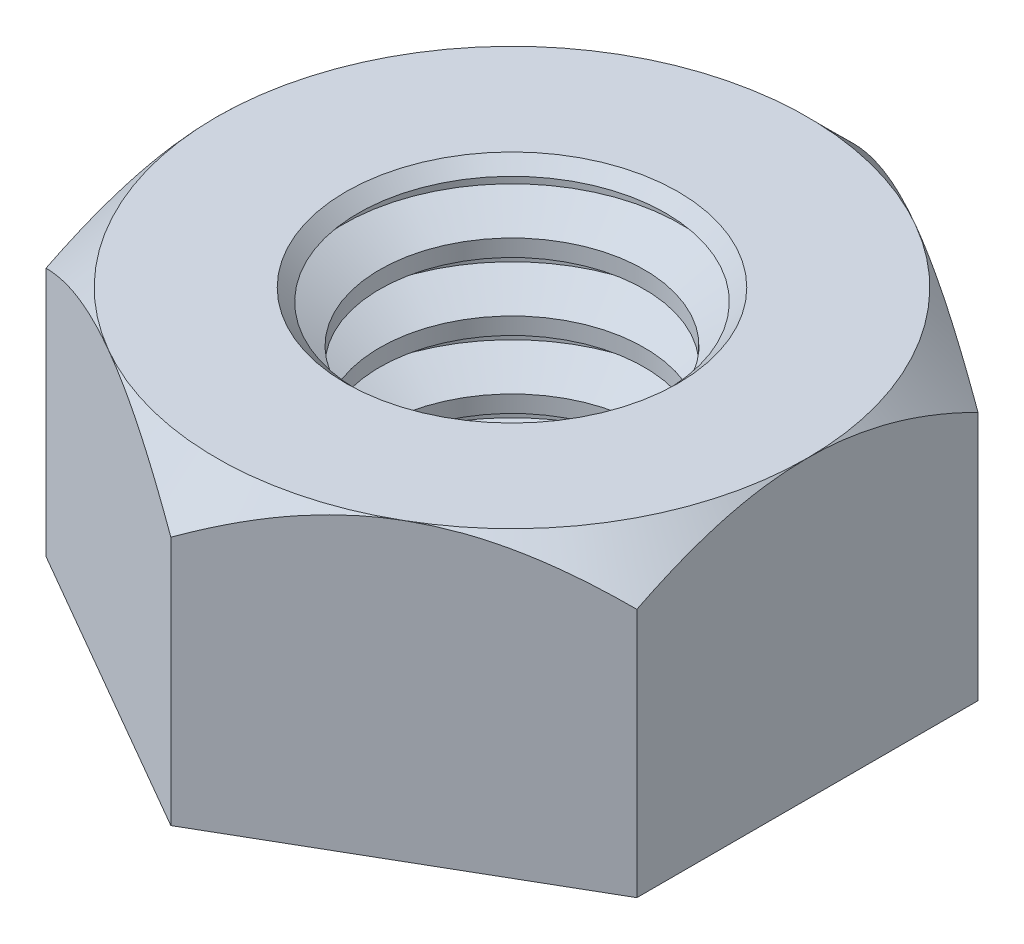
ISO-10303-21;
HEADER;
FILE_DESCRIPTION(('STEP AP214'),'2;1');
FILE_NAME('part.step','',(''),(''),'','','');
FILE_SCHEMA(('AUTOMOTIVE_DESIGN { 1 0 10303 214 1 1 1 1 }'));
ENDSEC;
DATA;
#1=APPLICATION_CONTEXT('core data for automotive mechanical design processes');
#2=APPLICATION_PROTOCOL_DEFINITION('international standard','automotive_design',2000,#1);
#3=PRODUCT_CONTEXT('',#1,'mechanical');
#4=PRODUCT('Part','Part','',(#3));
#5=PRODUCT_RELATED_PRODUCT_CATEGORY('part','',(#4));
#6=PRODUCT_DEFINITION_FORMATION('','',#4);
#7=PRODUCT_DEFINITION_CONTEXT('part definition',#1,'design');
#8=PRODUCT_DEFINITION('design','',#6,#7);
#9=PRODUCT_DEFINITION_SHAPE('','',#8);
#10=(LENGTH_UNIT() NAMED_UNIT(*) SI_UNIT(.MILLI.,.METRE.));
#11=(NAMED_UNIT(*) PLANE_ANGLE_UNIT() SI_UNIT($,.RADIAN.));
#12=(NAMED_UNIT(*) SI_UNIT($,.STERADIAN.) SOLID_ANGLE_UNIT());
#13=UNCERTAINTY_MEASURE_WITH_UNIT(LENGTH_MEASURE(1.E-05),#10,'distance_accuracy_value','');
#14=(GEOMETRIC_REPRESENTATION_CONTEXT(3) GLOBAL_UNCERTAINTY_ASSIGNED_CONTEXT((#13)) GLOBAL_UNIT_ASSIGNED_CONTEXT((#10,
#11,#12)) REPRESENTATION_CONTEXT('',''));
#15=CARTESIAN_POINT('',(0.,0.,0.));
#16=DIRECTION('',(0.,0.,1.));
#17=DIRECTION('',(1.,0.,0.));
#18=AXIS2_PLACEMENT_3D('',#15,#16,#17);
#19=CARTESIAN_POINT('',(-5.55625,0.,-9.62370729955457));
#20=DIRECTION('',(0.,1.,0.));
#21=DIRECTION('',(0.,0.,1.));
#22=AXIS2_PLACEMENT_3D('',#19,#20,#21);
#23=PLANE('',#22);
#24=DIRECTION('',(-0.866025403784439,0.,-0.5));
#25=VECTOR('',#24,1.);
#26=CARTESIAN_POINT('',(5.55625,0.,-3.20790243318486));
#27=LINE('',#26,#25);
#28=CARTESIAN_POINT('',(5.55625,0.,-3.20790243318486));
#29=VERTEX_POINT('',#28);
#30=CARTESIAN_POINT('',(0.,0.,-6.41580486636972));
#31=VERTEX_POINT('',#30);
#32=EDGE_CURVE('E263',#29,#31,#27,.T.);
#33=ORIENTED_EDGE('',*,*,#32,.F.);
#34=DIRECTION('',(0.,0.,-1.));
#35=VECTOR('',#34,1.);
#36=CARTESIAN_POINT('',(5.55625,0.,3.20790243318485));
#37=LINE('',#36,#35);
#38=CARTESIAN_POINT('',(5.55625,0.,3.20790243318485));
#39=VERTEX_POINT('',#38);
#40=EDGE_CURVE('E270',#39,#29,#37,.T.);
#41=ORIENTED_EDGE('',*,*,#40,.F.);
#42=DIRECTION('',(0.866025403784439,0.,-0.5));
#43=VECTOR('',#42,1.);
#44=CARTESIAN_POINT('',(0.,0.,6.41580486636971));
#45=LINE('',#44,#43);
#46=CARTESIAN_POINT('',(0.,0.,6.41580486636971));
#47=VERTEX_POINT('',#46);
#48=EDGE_CURVE('E266',#47,#39,#45,.T.);
#49=ORIENTED_EDGE('',*,*,#48,.F.);
#50=DIRECTION('',(0.866025403784439,0.,0.5));
#51=VECTOR('',#50,1.);
#52=CARTESIAN_POINT('',(-5.55625,0.,3.20790243318486));
#53=LINE('',#52,#51);
#54=CARTESIAN_POINT('',(-5.55625,0.,3.20790243318486));
#55=VERTEX_POINT('',#54);
#56=EDGE_CURVE('E124',#55,#47,#53,.T.);
#57=ORIENTED_EDGE('',*,*,#56,.F.);
#58=DIRECTION('',(0.,0.,1.));
#59=VECTOR('',#58,1.);
#60=CARTESIAN_POINT('',(-5.55625,0.,-3.20790243318486));
#61=LINE('',#60,#59);
#62=CARTESIAN_POINT('',(-5.55625,0.,-3.20790243318486));
#63=VERTEX_POINT('',#62);
#64=EDGE_CURVE('E262',#63,#55,#61,.T.);
#65=ORIENTED_EDGE('',*,*,#64,.F.);
#66=DIRECTION('',(-0.866025403784438,0.,0.5));
#67=VECTOR('',#66,1.);
#68=CARTESIAN_POINT('',(0.,0.,-6.41580486636972));
#69=LINE('',#68,#67);
#70=EDGE_CURVE('E258',#31,#63,#69,.T.);
#71=ORIENTED_EDGE('',*,*,#70,.F.);
#72=EDGE_LOOP('',(#33,#41,#49,#57,#65,#71));
#73=FACE_BOUND('',#72,.T.);
#74=CARTESIAN_POINT('',(0.,0.,0.));
#75=DIRECTION('',(0.,1.,0.));
#76=DIRECTION('',(0.,0.,1.));
#77=AXIS2_PLACEMENT_3D('',#74,#75,#76);
#78=CIRCLE('',#77,3.175);
#79=CARTESIAN_POINT('',(0.,0.,3.175));
#80=VERTEX_POINT('',#79);
#81=EDGE_CURVE('E141',#80,#80,#78,.F.);
#82=ORIENTED_EDGE('',*,*,#81,.F.);
#83=EDGE_LOOP('',(#82));
#84=FACE_BOUND('',#83,.T.);
#85=ADVANCED_FACE('F31',(#73,#84),#23,.F.);
#86=CARTESIAN_POINT('',(-5.55625,5.55625,-9.62370729955457));
#87=DIRECTION('',(0.,1.,0.));
#88=DIRECTION('',(0.,0.,1.));
#89=AXIS2_PLACEMENT_3D('',#86,#87,#88);
#90=PLANE('',#89);
#91=CARTESIAN_POINT('',(0.,5.55625,0.));
#92=DIRECTION('',(0.,1.,0.));
#93=DIRECTION('',(0.,0.,1.));
#94=AXIS2_PLACEMENT_3D('',#91,#92,#93);
#95=CIRCLE('',#94,3.1225923357461);
#96=CARTESIAN_POINT('',(0.,5.55625,3.1225923357461));
#97=VERTEX_POINT('',#96);
#98=EDGE_CURVE('E12',#97,#97,#95,.F.);
#99=ORIENTED_EDGE('',*,*,#98,.T.);
#100=EDGE_LOOP('',(#99));
#101=FACE_BOUND('',#100,.T.);
#102=CARTESIAN_POINT('',(0.,5.55625,0.));
#103=DIRECTION('',(0.,1.,0.));
#104=DIRECTION('',(0.,0.,1.));
#105=AXIS2_PLACEMENT_3D('',#102,#103,#104);
#106=CIRCLE('',#105,5.55625);
#107=CARTESIAN_POINT('',(-2.778125,5.55625,4.81185364977729));
#108=VERTEX_POINT('',#107);
#109=CARTESIAN_POINT('',(2.778125,5.55625,4.81185364977729));
#110=VERTEX_POINT('',#109);
#111=EDGE_CURVE('E106',#108,#110,#106,.T.);
#112=ORIENTED_EDGE('',*,*,#111,.T.);
#113=CARTESIAN_POINT('',(0.,5.55625,0.));
#114=DIRECTION('',(0.,1.,0.));
#115=DIRECTION('',(0.,0.,1.));
#116=AXIS2_PLACEMENT_3D('',#113,#114,#115);
#117=CIRCLE('',#116,5.55625);
#118=CARTESIAN_POINT('',(5.55625,5.55625,0.));
#119=VERTEX_POINT('',#118);
#120=EDGE_CURVE('E46',#110,#119,#117,.T.);
#121=ORIENTED_EDGE('',*,*,#120,.T.);
#122=CARTESIAN_POINT('',(2.778125,5.55625,-4.81185364977729));
#123=VERTEX_POINT('',#122);
#124=EDGE_CURVE('E140',#119,#123,#106,.T.);
#125=ORIENTED_EDGE('',*,*,#124,.T.);
#126=CARTESIAN_POINT('',(-2.778125,5.55625,-4.81185364977728));
#127=VERTEX_POINT('',#126);
#128=EDGE_CURVE('E148',#123,#127,#106,.T.);
#129=ORIENTED_EDGE('',*,*,#128,.T.);
#130=CARTESIAN_POINT('',(-5.55625,5.55625,0.));
#131=VERTEX_POINT('',#130);
#132=EDGE_CURVE('E151',#127,#131,#106,.T.);
#133=ORIENTED_EDGE('',*,*,#132,.T.);
#134=EDGE_CURVE('E139',#131,#108,#106,.T.);
#135=ORIENTED_EDGE('',*,*,#134,.T.);
#136=EDGE_LOOP('',(#112,#121,#125,#129,#133,#135));
#137=FACE_BOUND('',#136,.T.);
#138=ADVANCED_FACE('F158',(#101,#137),#90,.T.);
#139=CARTESIAN_POINT('',(5.55625,5.55625,-3.20790243318486));
#140=DIRECTION('',(-0.5,0.,0.866025403784439));
#141=DIRECTION('',(0.866025403784439,0.,0.5));
#142=AXIS2_PLACEMENT_3D('',#139,#140,#141);
#143=PLANE('',#142);
#144=CARTESIAN_POINT('',(5.55645,4.69657966045921,-3.20778696313103));
#145=CARTESIAN_POINT('',(5.46091343213634,4.75173242203482,-3.26294502630456));
#146=CARTESIAN_POINT('',(5.36464252189313,4.80519263942161,-3.31852706224861));
#147=CARTESIAN_POINT('',(5.17048794724758,4.90821311667276,-3.43062225818461));
#148=CARTESIAN_POINT('',(5.07260343681126,4.957771246525,-3.48713590663452));
#149=CARTESIAN_POINT('',(4.77540401935947,5.10024281917033,-3.65872407030331));
#150=CARTESIAN_POINT('',(4.57357316067263,5.18634564665251,-3.77525117089693));
#151=CARTESIAN_POINT('',(4.16656508355582,5.33379085611819,-4.01023739378267));
#152=CARTESIAN_POINT('',(3.96149189520966,5.39550470595628,-4.1286364542779));
#153=CARTESIAN_POINT('',(3.65051060791048,5.46689250337744,-4.30818158421302));
#154=CARTESIAN_POINT('',(3.54639232726792,5.48714839260829,-4.36829430156956));
#155=CARTESIAN_POINT('',(3.33727417686003,5.5201408034146,-4.489028722));
#156=CARTESIAN_POINT('',(3.23227444122894,5.53287844876181,-4.54965034763144));
#157=CARTESIAN_POINT('',(2.97640553758584,5.55423487487138,-4.69737632802704));
#158=CARTESIAN_POINT('',(2.8252606832748,5.55871592717981,-4.78463985035015));
#159=CARTESIAN_POINT('',(2.52324337968537,5.55119519640634,-4.95900962187743));
#160=CARTESIAN_POINT('',(2.37237104445616,5.53918763540787,-5.04611580523528));
#161=CARTESIAN_POINT('',(2.07204876192232,5.49939747805151,-5.21950695589983));
#162=CARTESIAN_POINT('',(1.92260059568404,5.47159724001052,-5.30579089490741));
#163=CARTESIAN_POINT('',(1.62627290818361,5.40173312732753,-5.47687576505412));
#164=CARTESIAN_POINT('',(1.47939319087123,5.35967034639006,-5.56167680938292));
#165=CARTESIAN_POINT('',(1.21865351473497,5.27313363508139,-5.7122149315886));
#166=CARTESIAN_POINT('',(1.10421623532562,5.23093545710749,-5.77828532566092));
#167=CARTESIAN_POINT('',(0.877395992982083,5.13973889719048,-5.90924005363561));
#168=CARTESIAN_POINT('',(0.765013092503048,5.09074030889599,-5.9741243514795));
#169=CARTESIAN_POINT('',(0.542655571971707,4.98704132435942,-6.1025025258146));
#170=CARTESIAN_POINT('',(0.432674627909832,4.93235885880868,-6.16600005347446));
#171=CARTESIAN_POINT('',(0.214749315775353,4.81801006386822,-6.29181929109853));
#172=CARTESIAN_POINT('',(0.106803747721914,4.75834679124865,-6.35414169387201));
#173=CARTESIAN_POINT('',(-0.000200000000001823,4.6965796604592,-6.41592033642356));
#174=B_SPLINE_CURVE_WITH_KNOTS('',3,(#144,#145,#146,#147,#148,#149,#150,#151,#152,#153,#154,
#155,#156,#157,#158,#159,#160,#161,#162,#163,#164,#165,#166,#167,#168,#169,#170,#171,#172,#173),
.UNSPECIFIED.,.F.,.F.,(4,2,2,2,2,2,2,2,2,2,2,2,2,2,4),(0.,0.369982774103464,0.740166128456627,
1.48452951278214,2.21707291656615,2.58262618134807,2.94812479207228,3.4710646892481,
3.99418788105354,4.5178965956618,5.0415651594282,5.45751515378561,5.87347777247331,
6.28816585755633,6.70260128950947),.UNSPECIFIED.);
#175=CARTESIAN_POINT('',(5.55625,4.69669513363029,-3.20790243318487));
#176=VERTEX_POINT('',#175);
#177=EDGE_CURVE('E273',#176,#123,#174,.T.);
#178=ORIENTED_EDGE('',*,*,#177,.F.);
#179=DIRECTION('',(0.,-1.,0.));
#180=VECTOR('',#179,1.);
#181=CARTESIAN_POINT('',(5.55625,5.55625,-3.20790243318486));
#182=LINE('',#181,#180);
#183=EDGE_CURVE('E131',#176,#29,#182,.T.);
#184=ORIENTED_EDGE('',*,*,#183,.T.);
#185=ORIENTED_EDGE('',*,*,#32,.T.);
#186=DIRECTION('',(0.,-1.,0.));
#187=VECTOR('',#186,1.);
#188=CARTESIAN_POINT('',(0.,5.55625,-6.41580486636972));
#189=LINE('',#188,#187);
#190=CARTESIAN_POINT('',(0.,4.69669513363029,-6.41580486636972));
#191=VERTEX_POINT('',#190);
#192=EDGE_CURVE('E136',#191,#31,#189,.T.);
#193=ORIENTED_EDGE('',*,*,#192,.F.);
#194=EDGE_CURVE('E210',#123,#191,#174,.T.);
#195=ORIENTED_EDGE('',*,*,#194,.F.);
#196=EDGE_LOOP('',(#178,#184,#185,#193,#195));
#197=FACE_BOUND('',#196,.T.);
#198=ADVANCED_FACE('F219',(#197),#143,.F.);
#199=CARTESIAN_POINT('',(0.,5.55625,-6.41580486636972));
#200=DIRECTION('',(0.5,0.,0.866025403784438));
#201=DIRECTION('',(0.866025403784438,0.,-0.5));
#202=AXIS2_PLACEMENT_3D('',#199,#200,#201);
#203=PLANE('',#202);
#204=CARTESIAN_POINT('',(0.000199999999998073,4.6965796604592,-6.41592033642356));
#205=CARTESIAN_POINT('',(-0.095336567863664,4.75173242203482,-6.36076227325002));
#206=CARTESIAN_POINT('',(-0.191607478106876,4.80519263942161,-6.30518023730597));
#207=CARTESIAN_POINT('',(-0.38576205275242,4.90821311667276,-6.19308504136997));
#208=CARTESIAN_POINT('',(-0.483646563188737,4.957771246525,-6.13657139292007));
#209=CARTESIAN_POINT('',(-0.780845980640529,5.10024281917033,-5.96498322925127));
#210=CARTESIAN_POINT('',(-0.982676839327371,5.18634564665251,-5.84845612865765));
#211=CARTESIAN_POINT('',(-1.38968491644419,5.33379085611819,-5.61346990577191));
#212=CARTESIAN_POINT('',(-1.59475810479034,5.39550470595628,-5.49507084527668));
#213=CARTESIAN_POINT('',(-1.90573939208952,5.46689250337744,-5.31552571534156));
#214=CARTESIAN_POINT('',(-2.00985767273208,5.48714839260829,-5.25541299798502));
#215=CARTESIAN_POINT('',(-2.21897582313997,5.5201408034146,-5.13467857755458));
#216=CARTESIAN_POINT('',(-2.32397555877106,5.53287844876181,-5.07405695192314));
#217=CARTESIAN_POINT('',(-2.57984446241416,5.55423487487139,-4.92633097152754));
#218=CARTESIAN_POINT('',(-2.7309893167252,5.55871592717981,-4.83906744920443));
#219=CARTESIAN_POINT('',(-3.03300662031463,5.55119519640634,-4.66469767767715));
#220=CARTESIAN_POINT('',(-3.18387895554384,5.53918763540787,-4.5775914943193));
#221=CARTESIAN_POINT('',(-3.48420123807768,5.49939747805151,-4.40420034365474));
#222=CARTESIAN_POINT('',(-3.63364940431597,5.47159724001052,-4.31791640464717));
#223=CARTESIAN_POINT('',(-3.92997709181639,5.40173312732753,-4.14683153450046));
#224=CARTESIAN_POINT('',(-4.07685680912878,5.35967034639006,-4.06203049017166));
#225=CARTESIAN_POINT('',(-4.33759648526503,5.27313363508139,-3.91149236796598));
#226=CARTESIAN_POINT('',(-4.45203376467438,5.23093545710749,-3.84542197389366));
#227=CARTESIAN_POINT('',(-4.67885400701792,5.13973889719048,-3.71446724591896));
#228=CARTESIAN_POINT('',(-4.79123690749695,5.09074030889599,-3.64958294807508));
#229=CARTESIAN_POINT('',(-5.01359442802829,4.98704132435942,-3.52120477373998));
#230=CARTESIAN_POINT('',(-5.12357537209017,4.93235885880868,-3.45770724608012));
#231=CARTESIAN_POINT('',(-5.34150068422465,4.81801006386822,-3.33188800845605));
#232=CARTESIAN_POINT('',(-5.44944625227808,4.75834679124865,-3.26956560568257));
#233=CARTESIAN_POINT('',(-5.55645,4.69657966045921,-3.20778696313102));
#234=B_SPLINE_CURVE_WITH_KNOTS('',3,(#204,#205,#206,#207,#208,#209,#210,#211,#212,#213,#214,
#215,#216,#217,#218,#219,#220,#221,#222,#223,#224,#225,#226,#227,#228,#229,#230,#231,#232,#233),
.UNSPECIFIED.,.F.,.F.,(4,2,2,2,2,2,2,2,2,2,2,2,2,2,4),(0.,0.369982774103465,0.740166128456628,
1.48452951278214,2.21707291656615,2.58262618134807,2.94812479207228,3.4710646892481,
3.99418788105354,4.51789659566181,5.0415651594282,5.45751515378561,5.87347777247331,
6.28816585755633,6.70260128950946),.UNSPECIFIED.);
#235=EDGE_CURVE('E209',#191,#127,#234,.T.);
#236=ORIENTED_EDGE('',*,*,#235,.F.);
#237=ORIENTED_EDGE('',*,*,#192,.T.);
#238=ORIENTED_EDGE('',*,*,#70,.T.);
#239=DIRECTION('',(0.,-1.,0.));
#240=VECTOR('',#239,1.);
#241=CARTESIAN_POINT('',(-5.55625,5.55625,-3.20790243318486));
#242=LINE('',#241,#240);
#243=CARTESIAN_POINT('',(-5.55625,4.69669513363029,-3.20790243318487));
#244=VERTEX_POINT('',#243);
#245=EDGE_CURVE('E129',#244,#63,#242,.T.);
#246=ORIENTED_EDGE('',*,*,#245,.F.);
#247=EDGE_CURVE('E204',#127,#244,#234,.T.);
#248=ORIENTED_EDGE('',*,*,#247,.F.);
#249=EDGE_LOOP('',(#236,#237,#238,#246,#248));
#250=FACE_BOUND('',#249,.T.);
#251=ADVANCED_FACE('F215',(#250),#203,.F.);
#252=CARTESIAN_POINT('',(-5.55625,5.55625,-3.20790243318486));
#253=DIRECTION('',(1.,0.,0.));
#254=DIRECTION('',(0.,0.,-1.));
#255=AXIS2_PLACEMENT_3D('',#252,#253,#254);
#256=PLANE('',#255);
#257=CARTESIAN_POINT('',(-5.55625,2.41250237411444,-6.69462804253641));
#258=CARTESIAN_POINT('',(-5.55625,2.53693227433918,-6.53288896397683));
#259=CARTESIAN_POINT('',(-5.55625,2.66024718999982,-6.37027840513361));
#260=CARTESIAN_POINT('',(-5.55625,2.9041376563216,-6.04295812427312));
#261=CARTESIAN_POINT('',(-5.55625,3.02471255198103,-5.87824791472215));
#262=CARTESIAN_POINT('',(-5.55625,3.26347164698379,-5.54516847521053));
#263=CARTESIAN_POINT('',(-5.55625,3.38163022615723,-5.37678081987583));
#264=CARTESIAN_POINT('',(-5.55625,3.61383543437335,-5.03720304557114));
#265=CARTESIAN_POINT('',(-5.55625,3.72788234654862,-4.86601312075254));
#266=CARTESIAN_POINT('',(-5.55625,3.95799921257433,-4.50940049117487));
#267=CARTESIAN_POINT('',(-5.55625,4.07373890490229,-4.32376359881791));
#268=CARTESIAN_POINT('',(-5.55625,4.29803450791509,-3.94813041827828));
#269=CARTESIAN_POINT('',(-5.55625,4.40658920963514,-3.75813340365686));
#270=CARTESIAN_POINT('',(-5.55625,4.61420300798015,-3.3737280031191));
#271=CARTESIAN_POINT('',(-5.55625,4.71328997900681,-3.17933479056672));
#272=CARTESIAN_POINT('',(-5.55625,4.89974829362054,-2.78505305566985));
#273=CARTESIAN_POINT('',(-5.55625,4.98712516399104,-2.58516717974399));
#274=CARTESIAN_POINT('',(-5.55625,5.13910722026849,-2.19948175827626));
#275=CARTESIAN_POINT('',(-5.55625,5.2051085330491,-2.01423801690822));
#276=CARTESIAN_POINT('',(-5.55625,5.32228353515477,-1.63903108102974));
#277=CARTESIAN_POINT('',(-5.55625,5.37345628004511,-1.44906758675344));
#278=CARTESIAN_POINT('',(-5.55625,5.45735124336137,-1.068864178286));
#279=CARTESIAN_POINT('',(-5.55625,5.49040857019227,-0.878699472171357));
#280=CARTESIAN_POINT('',(-5.55625,5.53738306010249,-0.496007422516545));
#281=CARTESIAN_POINT('',(-5.55625,5.55130419422253,-0.303480577523763));
#282=CARTESIAN_POINT('',(-5.55625,5.55882046975347,0.0735518345339309));
#283=CARTESIAN_POINT('',(-5.55625,5.55327700102539,0.25804038967667));
#284=CARTESIAN_POINT('',(-5.55625,5.52414759367244,0.625577837142417));
#285=CARTESIAN_POINT('',(-5.55625,5.50056001622466,0.808626597172998));
#286=CARTESIAN_POINT('',(-5.55625,5.43627517911149,1.17506191276843));
#287=CARTESIAN_POINT('',(-5.55625,5.39527584522011,1.35839456874863));
#288=CARTESIAN_POINT('',(-5.55625,5.29844208535446,1.72102257275768));
#289=CARTESIAN_POINT('',(-5.55625,5.2426085019478,1.90031814946058));
#290=CARTESIAN_POINT('',(-5.55625,5.11498441740951,2.26474953636822));
#291=CARTESIAN_POINT('',(-5.55625,5.04245880807491,2.4496249634008));
#292=CARTESIAN_POINT('',(-5.55625,4.88620286281552,2.81462047841473));
#293=CARTESIAN_POINT('',(-5.55625,4.80246747466083,2.9947383781025));
#294=CARTESIAN_POINT('',(-5.55625,4.6257777385301,3.35106945614426));
#295=CARTESIAN_POINT('',(-5.55625,4.5327949960131,3.52726843963966));
#296=CARTESIAN_POINT('',(-5.55625,4.33965674040692,3.87562889070534));
#297=CARTESIAN_POINT('',(-5.55625,4.23950233170891,4.04779097453539));
#298=CARTESIAN_POINT('',(-5.55625,4.03850906915051,4.38019101425603));
#299=CARTESIAN_POINT('',(-5.55625,3.93794824314362,4.54059797903958));
#300=CARTESIAN_POINT('',(-5.55625,3.73254621589371,4.85865599636929));
#301=CARTESIAN_POINT('',(-5.55625,3.62770469373252,5.01630684102276));
#302=CARTESIAN_POINT('',(-5.55625,3.41535812953187,5.32794570046362));
#303=CARTESIAN_POINT('',(-5.55625,3.30788123098823,5.48195296104594));
#304=CARTESIAN_POINT('',(-5.55625,3.09004635660311,5.78785471184435));
#305=CARTESIAN_POINT('',(-5.55625,2.97968918314125,5.93974977277418));
#306=CARTESIAN_POINT('',(-5.55625,2.86815303866691,6.09075879971803));
#307=B_SPLINE_CURVE_WITH_KNOTS('',3,(#257,#258,#259,#260,#261,#262,#263,#264,#265,#266,#267,
#268,#269,#270,#271,#272,#273,#274,#275,#276,#277,#278,#279,#280,#281,#282,#283,#284,#285,#286,
#287,#288,#289,#290,#291,#292,#293,#294,#295,#296,#297,#298,#299,#300,#301,#302,#303,#304,#305,
#306),.UNSPECIFIED.,.F.,.F.,(4,2,2,2,2,2,2,2,2,2,2,2,2,2,2,2,2,2,2,2,2,2,2,2,4),(0.,
0.612204800845371,1.22455444165172,1.84162824215584,2.45865946900041,3.11481563241323,
3.77108192312042,4.4253523486488,5.07931288427599,5.66875591046265,6.25823647015662,
6.83640892109926,7.41446137465495,7.96726113269174,8.52011110370917,9.08297162147485,
9.64580017626965,10.2411205205148,10.8367100837405,11.4341884807678,12.0315750669586,
12.5994618560285,13.1673912972773,13.73076089802,14.2939751974551),.UNSPECIFIED.);
#308=EDGE_CURVE('E163',#244,#131,#307,.T.);
#309=ORIENTED_EDGE('',*,*,#308,.F.);
#310=ORIENTED_EDGE('',*,*,#245,.T.);
#311=ORIENTED_EDGE('',*,*,#64,.T.);
#312=DIRECTION('',(0.,-1.,0.));
#313=VECTOR('',#312,1.);
#314=CARTESIAN_POINT('',(-5.55625,5.55625,3.20790243318486));
#315=LINE('',#314,#313);
#316=CARTESIAN_POINT('',(-5.55625000000001,4.69669513363029,3.20790243318485));
#317=VERTEX_POINT('',#316);
#318=EDGE_CURVE('E126',#317,#55,#315,.T.);
#319=ORIENTED_EDGE('',*,*,#318,.F.);
#320=EDGE_CURVE('E161',#131,#317,#307,.T.);
#321=ORIENTED_EDGE('',*,*,#320,.F.);
#322=EDGE_LOOP('',(#309,#310,#311,#319,#321));
#323=FACE_BOUND('',#322,.T.);
#324=ADVANCED_FACE('F218',(#323),#256,.F.);
#325=CARTESIAN_POINT('',(-5.55625,5.55625,3.20790243318486));
#326=DIRECTION('',(0.5,0.,-0.866025403784439));
#327=DIRECTION('',(-0.866025403784439,0.,-0.5));
#328=AXIS2_PLACEMENT_3D('',#325,#326,#327);
#329=PLANE('',#328);
#330=CARTESIAN_POINT('',(-5.55645,4.69657966045921,3.20778696313102));
#331=CARTESIAN_POINT('',(-5.46091343213634,4.75173242203482,3.26294502630456));
#332=CARTESIAN_POINT('',(-5.36464252189312,4.80519263942161,3.3185270622486));
#333=CARTESIAN_POINT('',(-5.17048794724758,4.90821311667276,3.43062225818461));
#334=CARTESIAN_POINT('',(-5.07260343681126,4.957771246525,3.48713590663451));
#335=CARTESIAN_POINT('',(-4.77540401935947,5.10024281917034,3.6587240703033));
#336=CARTESIAN_POINT('',(-4.57357316067263,5.18634564665252,3.77525117089692));
#337=CARTESIAN_POINT('',(-4.16656508355582,5.33379085611819,4.01023739378267));
#338=CARTESIAN_POINT('',(-3.96149189520966,5.39550470595629,4.12863645427789));
#339=CARTESIAN_POINT('',(-3.65051060791048,5.46689250337744,4.30818158421301));
#340=CARTESIAN_POINT('',(-3.54639232726792,5.4871483926083,4.36829430156956));
#341=CARTESIAN_POINT('',(-3.33727417686003,5.5201408034146,4.48902872199999));
#342=CARTESIAN_POINT('',(-3.23227444122894,5.53287844876182,4.54965034763144));
#343=CARTESIAN_POINT('',(-2.97640553758584,5.55423487487139,4.69737632802703));
#344=CARTESIAN_POINT('',(-2.8252606832748,5.55871592717982,4.78463985035014));
#345=CARTESIAN_POINT('',(-2.52324337968537,5.55119519640635,4.95900962187742));
#346=CARTESIAN_POINT('',(-2.37237104445616,5.53918763540787,5.04611580523528));
#347=CARTESIAN_POINT('',(-2.07204876192232,5.49939747805152,5.21950695589983));
#348=CARTESIAN_POINT('',(-1.92260059568404,5.47159724001053,5.3057908949074));
#349=CARTESIAN_POINT('',(-1.62627290818361,5.40173312732754,5.47687576505411));
#350=CARTESIAN_POINT('',(-1.47939319087123,5.35967034639007,5.56167680938291));
#351=CARTESIAN_POINT('',(-1.21865351473497,5.2731336350814,5.71221493158859));
#352=CARTESIAN_POINT('',(-1.10421623532562,5.2309354571075,5.77828532566091));
#353=CARTESIAN_POINT('',(-0.877395992982083,5.13973889719049,5.90924005363561));
#354=CARTESIAN_POINT('',(-0.765013092503048,5.090740308896,5.97412435147949));
#355=CARTESIAN_POINT('',(-0.542655571971706,4.98704132435942,6.1025025258146));
#356=CARTESIAN_POINT('',(-0.432674627909832,4.93235885880868,6.16600005347445));
#357=CARTESIAN_POINT('',(-0.214749315775353,4.81801006386823,6.29181929109852));
#358=CARTESIAN_POINT('',(-0.106803747721915,4.75834679124866,6.354141693872));
#359=CARTESIAN_POINT('',(0.000200000000000166,4.69657966045921,6.41592033642355));
#360=B_SPLINE_CURVE_WITH_KNOTS('',3,(#330,#331,#332,#333,#334,#335,#336,#337,#338,#339,#340,
#341,#342,#343,#344,#345,#346,#347,#348,#349,#350,#351,#352,#353,#354,#355,#356,#357,#358,#359),
.UNSPECIFIED.,.F.,.F.,(4,2,2,2,2,2,2,2,2,2,2,2,2,2,4),(0.,0.369982774103465,0.740166128456627,
1.48452951278214,2.21707291656615,2.58262618134807,2.94812479207228,3.4710646892481,
3.99418788105354,4.5178965956618,5.0415651594282,5.45751515378561,5.87347777247331,
6.28816585755633,6.70260128950947),.UNSPECIFIED.);
#361=EDGE_CURVE('E111',#317,#108,#360,.T.);
#362=ORIENTED_EDGE('',*,*,#361,.F.);
#363=ORIENTED_EDGE('',*,*,#318,.T.);
#364=ORIENTED_EDGE('',*,*,#56,.T.);
#365=DIRECTION('',(0.,-1.,0.));
#366=VECTOR('',#365,1.);
#367=CARTESIAN_POINT('',(0.,5.55625,6.41580486636971));
#368=LINE('',#367,#366);
#369=CARTESIAN_POINT('',(0.,4.69669513363029,6.41580486636972));
#370=VERTEX_POINT('',#369);
#371=EDGE_CURVE('E117',#370,#47,#368,.T.);
#372=ORIENTED_EDGE('',*,*,#371,.F.);
#373=EDGE_CURVE('E102',#108,#370,#360,.T.);
#374=ORIENTED_EDGE('',*,*,#373,.F.);
#375=EDGE_LOOP('',(#362,#363,#364,#372,#374));
#376=FACE_BOUND('',#375,.T.);
#377=ADVANCED_FACE('F122',(#376),#329,.F.);
#378=CARTESIAN_POINT('',(0.,5.55625,6.41580486636971));
#379=DIRECTION('',(-0.5,0.,-0.866025403784438));
#380=DIRECTION('',(-0.866025403784439,0.,0.5));
#381=AXIS2_PLACEMENT_3D('',#378,#379,#380);
#382=PLANE('',#381);
#383=CARTESIAN_POINT('',(-0.000199999999999911,4.69657966045921,6.41592033642355));
#384=CARTESIAN_POINT('',(0.0953365678636618,4.75173242203483,6.36076227325001));
#385=CARTESIAN_POINT('',(0.191607478106874,4.80519263942162,6.30518023730596));
#386=CARTESIAN_POINT('',(0.385762052752418,4.90821311667277,6.19308504136996));
#387=CARTESIAN_POINT('',(0.483646563188735,4.95777124652501,6.13657139292006));
#388=CARTESIAN_POINT('',(0.780845980640527,5.10024281917034,5.96498322925127));
#389=CARTESIAN_POINT('',(0.982676839327369,5.18634564665252,5.84845612865764));
#390=CARTESIAN_POINT('',(1.38968491644418,5.33379085611819,5.6134699057719));
#391=CARTESIAN_POINT('',(1.59475810479034,5.39550470595629,5.49507084527667));
#392=CARTESIAN_POINT('',(1.90573939208952,5.46689250337744,5.31552571534155));
#393=CARTESIAN_POINT('',(2.00985767273208,5.4871483926083,5.25541299798501));
#394=CARTESIAN_POINT('',(2.21897582313997,5.52014080341461,5.13467857755458));
#395=CARTESIAN_POINT('',(2.32397555877106,5.53287844876182,5.07405695192313));
#396=CARTESIAN_POINT('',(2.57984446241416,5.55423487487139,4.92633097152753));
#397=CARTESIAN_POINT('',(2.7309893167252,5.55871592717982,4.83906744920443));
#398=CARTESIAN_POINT('',(3.03300662031463,5.55119519640635,4.66469767767714));
#399=CARTESIAN_POINT('',(3.18387895554384,5.53918763540787,4.57759149431929));
#400=CARTESIAN_POINT('',(3.48420123807767,5.49939747805152,4.40420034365474));
#401=CARTESIAN_POINT('',(3.63364940431596,5.47159724001053,4.31791640464717));
#402=CARTESIAN_POINT('',(3.92997709181639,5.40173312732754,4.14683153450046));
#403=CARTESIAN_POINT('',(4.07685680912877,5.35967034639007,4.06203049017166));
#404=CARTESIAN_POINT('',(4.33759648526502,5.2731336350814,3.91149236796598));
#405=CARTESIAN_POINT('',(4.45203376467438,5.2309354571075,3.84542197389366));
#406=CARTESIAN_POINT('',(4.67885400701791,5.13973889719049,3.71446724591896));
#407=CARTESIAN_POINT('',(4.79123690749695,5.09074030889599,3.64958294807508));
#408=CARTESIAN_POINT('',(5.01359442802829,4.98704132435942,3.52120477373997));
#409=CARTESIAN_POINT('',(5.12357537209017,4.93235885880868,3.45770724608012));
#410=CARTESIAN_POINT('',(5.34150068422465,4.81801006386823,3.33188800845604));
#411=CARTESIAN_POINT('',(5.44944625227808,4.75834679124866,3.26956560568256));
#412=CARTESIAN_POINT('',(5.55645,4.69657966045921,3.20778696313102));
#413=B_SPLINE_CURVE_WITH_KNOTS('',3,(#383,#384,#385,#386,#387,#388,#389,#390,#391,#392,#393,
#394,#395,#396,#397,#398,#399,#400,#401,#402,#403,#404,#405,#406,#407,#408,#409,#410,#411,#412),
.UNSPECIFIED.,.F.,.F.,(4,2,2,2,2,2,2,2,2,2,2,2,2,2,4),(0.,0.369982774103465,0.740166128456627,
1.48452951278214,2.21707291656615,2.58262618134807,2.94812479207228,3.4710646892481,
3.99418788105354,4.5178965956618,5.0415651594282,5.45751515378561,5.87347777247331,
6.28816585755634,6.70260128950947),.UNSPECIFIED.);
#414=EDGE_CURVE('E105',#370,#110,#413,.T.);
#415=ORIENTED_EDGE('',*,*,#414,.F.);
#416=ORIENTED_EDGE('',*,*,#371,.T.);
#417=ORIENTED_EDGE('',*,*,#48,.T.);
#418=DIRECTION('',(0.,-1.,0.));
#419=VECTOR('',#418,1.);
#420=CARTESIAN_POINT('',(5.55625,5.55625,3.20790243318485));
#421=LINE('',#420,#419);
#422=CARTESIAN_POINT('',(5.55625,4.69669513363029,3.20790243318487));
#423=VERTEX_POINT('',#422);
#424=EDGE_CURVE('E127',#423,#39,#421,.T.);
#425=ORIENTED_EDGE('',*,*,#424,.F.);
#426=EDGE_CURVE('E120',#110,#423,#413,.T.);
#427=ORIENTED_EDGE('',*,*,#426,.F.);
#428=EDGE_LOOP('',(#415,#416,#417,#425,#427));
#429=FACE_BOUND('',#428,.T.);
#430=ADVANCED_FACE('F115',(#429),#382,.F.);
#431=CARTESIAN_POINT('',(5.55625,5.55625,3.20790243318485));
#432=DIRECTION('',(-1.,0.,0.));
#433=DIRECTION('',(0.,0.,1.));
#434=AXIS2_PLACEMENT_3D('',#431,#432,#433);
#435=PLANE('',#434);
#436=CARTESIAN_POINT('',(5.55625,2.41250237411444,-6.69462804253642));
#437=CARTESIAN_POINT('',(5.55625,2.53693227433918,-6.53288896397684));
#438=CARTESIAN_POINT('',(5.55625,2.66024718999982,-6.37027840513361));
#439=CARTESIAN_POINT('',(5.55625,2.9041376563216,-6.04295812427312));
#440=CARTESIAN_POINT('',(5.55625,3.02471255198103,-5.87824791472215));
#441=CARTESIAN_POINT('',(5.55625,3.26347164698379,-5.54516847521053));
#442=CARTESIAN_POINT('',(5.55625,3.38163022615723,-5.37678081987583));
#443=CARTESIAN_POINT('',(5.55625,3.61383543437335,-5.03720304557114));
#444=CARTESIAN_POINT('',(5.55625,3.72788234654862,-4.86601312075254));
#445=CARTESIAN_POINT('',(5.55625,3.95799921257433,-4.50940049117487));
#446=CARTESIAN_POINT('',(5.55625,4.07373890490229,-4.32376359881791));
#447=CARTESIAN_POINT('',(5.55625,4.29803450791509,-3.94813041827828));
#448=CARTESIAN_POINT('',(5.55625,4.40658920963513,-3.75813340365686));
#449=CARTESIAN_POINT('',(5.55625,4.61420300798014,-3.3737280031191));
#450=CARTESIAN_POINT('',(5.55625,4.71328997900681,-3.17933479056672));
#451=CARTESIAN_POINT('',(5.55625,4.89974829362053,-2.78505305566986));
#452=CARTESIAN_POINT('',(5.55625,4.98712516399104,-2.58516717974399));
#453=CARTESIAN_POINT('',(5.55625,5.13910722026849,-2.19948175827627));
#454=CARTESIAN_POINT('',(5.55625,5.2051085330491,-2.01423801690823));
#455=CARTESIAN_POINT('',(5.55625,5.32228353515476,-1.63903108102974));
#456=CARTESIAN_POINT('',(5.55625,5.37345628004511,-1.44906758675344));
#457=CARTESIAN_POINT('',(5.55625,5.45735124336137,-1.068864178286));
#458=CARTESIAN_POINT('',(5.55625,5.49040857019226,-0.878699472171357));
#459=CARTESIAN_POINT('',(5.55625,5.53738306010248,-0.496007422516543));
#460=CARTESIAN_POINT('',(5.55625,5.55130419422253,-0.303480577523761));
#461=CARTESIAN_POINT('',(5.55625,5.55882046975347,0.0735518345339328));
#462=CARTESIAN_POINT('',(5.55625,5.55327700102539,0.258040389676672));
#463=CARTESIAN_POINT('',(5.55625,5.52414759367244,0.625577837142419));
#464=CARTESIAN_POINT('',(5.55625,5.50056001622466,0.808626597173));
#465=CARTESIAN_POINT('',(5.55625,5.43627517911149,1.17506191276843));
#466=CARTESIAN_POINT('',(5.55625,5.39527584522011,1.35839456874863));
#467=CARTESIAN_POINT('',(5.55625,5.29844208535446,1.72102257275768));
#468=CARTESIAN_POINT('',(5.55625,5.24260850194779,1.90031814946059));
#469=CARTESIAN_POINT('',(5.55625,5.11498441740951,2.26474953636822));
#470=CARTESIAN_POINT('',(5.55625,5.04245880807491,2.4496249634008));
#471=CARTESIAN_POINT('',(5.55625,4.88620286281551,2.81462047841473));
#472=CARTESIAN_POINT('',(5.55625,4.80246747466082,2.99473837810251));
#473=CARTESIAN_POINT('',(5.55625,4.6257777385301,3.35106945614427));
#474=CARTESIAN_POINT('',(5.55625,4.5327949960131,3.52726843963966));
#475=CARTESIAN_POINT('',(5.55625,4.33965674040692,3.87562889070534));
#476=CARTESIAN_POINT('',(5.55625,4.23950233170891,4.0477909745354));
#477=CARTESIAN_POINT('',(5.55625,4.03850906915051,4.38019101425604));
#478=CARTESIAN_POINT('',(5.55625,3.93794824314362,4.54059797903958));
#479=CARTESIAN_POINT('',(5.55625,3.7325462158937,4.8586559963693));
#480=CARTESIAN_POINT('',(5.55625,3.62770469373251,5.01630684102276));
#481=CARTESIAN_POINT('',(5.55625,3.41535812953187,5.32794570046363));
#482=CARTESIAN_POINT('',(5.55625,3.30788123098822,5.48195296104595));
#483=CARTESIAN_POINT('',(5.55625,3.09004635660311,5.78785471184436));
#484=CARTESIAN_POINT('',(5.55625,2.97968918314124,5.93974977277419));
#485=CARTESIAN_POINT('',(5.55625,2.86815303866691,6.09075879971804));
#486=B_SPLINE_CURVE_WITH_KNOTS('',3,(#436,#437,#438,#439,#440,#441,#442,#443,#444,#445,#446,
#447,#448,#449,#450,#451,#452,#453,#454,#455,#456,#457,#458,#459,#460,#461,#462,#463,#464,#465,
#466,#467,#468,#469,#470,#471,#472,#473,#474,#475,#476,#477,#478,#479,#480,#481,#482,#483,#484,
#485),.UNSPECIFIED.,.F.,.F.,(4,2,2,2,2,2,2,2,2,2,2,2,2,2,2,2,2,2,2,2,2,2,2,2,4),(0.,
0.612204800845371,1.22455444165172,1.84162824215584,2.45865946900041,3.11481563241324,
3.77108192312042,4.4253523486488,5.07931288427599,5.66875591046265,6.25823647015663,
6.83640892109926,7.41446137465495,7.96726113269175,8.52011110370917,9.08297162147485,
9.64580017626966,10.2411205205148,10.8367100837405,11.4341884807678,12.0315750669586,
12.5994618560285,13.1673912972773,13.73076089802,14.2939751974551),.UNSPECIFIED.);
#487=EDGE_CURVE('E294',#423,#119,#486,.F.);
#488=ORIENTED_EDGE('',*,*,#487,.F.);
#489=ORIENTED_EDGE('',*,*,#424,.T.);
#490=ORIENTED_EDGE('',*,*,#40,.T.);
#491=ORIENTED_EDGE('',*,*,#183,.F.);
#492=EDGE_CURVE('E194',#119,#176,#486,.F.);
#493=ORIENTED_EDGE('',*,*,#492,.F.);
#494=EDGE_LOOP('',(#488,#489,#490,#491,#493));
#495=FACE_BOUND('',#494,.T.);
#496=ADVANCED_FACE('F236',(#495),#435,.F.);
#497=CARTESIAN_POINT('',(0.,5.55625,0.));
#498=DIRECTION('',(0.,-1.,0.));
#499=DIRECTION('',(0.,0.,-1.));
#500=AXIS2_PLACEMENT_3D('',#497,#498,#499);
#501=CONICAL_SURFACE('',#500,5.55625,0.785398163397453);
#502=ORIENTED_EDGE('',*,*,#373,.T.);
#503=ORIENTED_EDGE('',*,*,#414,.T.);
#504=ORIENTED_EDGE('',*,*,#111,.F.);
#505=EDGE_LOOP('',(#502,#503,#504));
#506=FACE_BOUND('',#505,.T.);
#507=ADVANCED_FACE('F104',(#506),#501,.T.);
#508=ORIENTED_EDGE('',*,*,#320,.T.);
#509=ORIENTED_EDGE('',*,*,#361,.T.);
#510=ORIENTED_EDGE('',*,*,#134,.F.);
#511=EDGE_LOOP('',(#508,#509,#510));
#512=FACE_BOUND('',#511,.T.);
#513=ADVANCED_FACE('F160',(#512),#501,.T.);
#514=ORIENTED_EDGE('',*,*,#247,.T.);
#515=ORIENTED_EDGE('',*,*,#308,.T.);
#516=ORIENTED_EDGE('',*,*,#132,.F.);
#517=EDGE_LOOP('',(#514,#515,#516));
#518=FACE_BOUND('',#517,.T.);
#519=ADVANCED_FACE('F278',(#518),#501,.T.);
#520=ORIENTED_EDGE('',*,*,#194,.T.);
#521=ORIENTED_EDGE('',*,*,#235,.T.);
#522=ORIENTED_EDGE('',*,*,#128,.F.);
#523=EDGE_LOOP('',(#520,#521,#522));
#524=FACE_BOUND('',#523,.T.);
#525=ADVANCED_FACE('F187',(#524),#501,.T.);
#526=ORIENTED_EDGE('',*,*,#177,.T.);
#527=ORIENTED_EDGE('',*,*,#124,.F.);
#528=ORIENTED_EDGE('',*,*,#492,.T.);
#529=EDGE_LOOP('',(#526,#527,#528));
#530=FACE_BOUND('',#529,.T.);
#531=ADVANCED_FACE('F181',(#530),#501,.T.);
#532=ORIENTED_EDGE('',*,*,#426,.T.);
#533=ORIENTED_EDGE('',*,*,#487,.T.);
#534=ORIENTED_EDGE('',*,*,#120,.F.);
#535=EDGE_LOOP('',(#532,#533,#534));
#536=FACE_BOUND('',#535,.T.);
#537=ADVANCED_FACE('F186',(#536),#501,.T.);
#538=CARTESIAN_POINT('',(0.,5.159375,0.));
#539=DIRECTION('',(0.,-1.,0.));
#540=DIRECTION('',(0.,0.,-1.));
#541=AXIS2_PLACEMENT_3D('',#538,#539,#540);
#542=CONICAL_SURFACE('',#541,3.175,1.0471975511966);
#543=CARTESIAN_POINT('',(0.,5.32382386859688,0.));
#544=DIRECTION('',(0.,1.,0.));
#545=DIRECTION('',(0.,0.,1.));
#546=AXIS2_PLACEMENT_3D('',#543,#544,#545);
#547=CIRCLE('',#546,2.89016620434298);
#548=CARTESIAN_POINT('',(0.,5.32382386859688,2.89016620434298));
#549=VERTEX_POINT('',#548);
#550=EDGE_CURVE('E39',#549,#549,#547,.T.);
#551=ORIENTED_EDGE('',*,*,#550,.T.);
#552=EDGE_LOOP('',(#551));
#553=FACE_BOUND('',#552,.T.);
#554=CARTESIAN_POINT('',(0.,5.159375,0.));
#555=DIRECTION('',(0.,1.,0.));
#556=DIRECTION('',(0.,0.,1.));
#557=AXIS2_PLACEMENT_3D('',#554,#555,#556);
#558=CIRCLE('',#557,3.175);
#559=CARTESIAN_POINT('',(0.,5.159375,3.175));
#560=VERTEX_POINT('',#559);
#561=EDGE_CURVE('E295',#560,#560,#558,.T.);
#562=ORIENTED_EDGE('',*,*,#561,.F.);
#563=EDGE_LOOP('',(#562));
#564=FACE_BOUND('',#563,.T.);
#565=ADVANCED_FACE('F189',(#553,#564),#542,.F.);
#566=CARTESIAN_POINT('',(0.,1.66357854098429,0.));
#567=DIRECTION('',(0.,1.,0.));
#568=DIRECTION('',(0.,0.,1.));
#569=AXIS2_PLACEMENT_3D('',#566,#567,#568);
#570=CYLINDRICAL_SURFACE('',#569,3.175);
#571=ORIENTED_EDGE('',*,*,#561,.T.);
#572=EDGE_LOOP('',(#571));
#573=FACE_BOUND('',#572,.T.);
#574=CARTESIAN_POINT('',(0.,5.000625,0.));
#575=DIRECTION('',(0.,1.,0.));
#576=DIRECTION('',(0.,0.,1.));
#577=AXIS2_PLACEMENT_3D('',#574,#575,#576);
#578=CIRCLE('',#577,3.175);
#579=CARTESIAN_POINT('',(0.,5.000625,3.175));
#580=VERTEX_POINT('',#579);
#581=EDGE_CURVE('E297',#580,#580,#578,.T.);
#582=ORIENTED_EDGE('',*,*,#581,.F.);
#583=EDGE_LOOP('',(#582));
#584=FACE_BOUND('',#583,.T.);
#585=ADVANCED_FACE('F293',(#573,#584),#570,.F.);
#586=CARTESIAN_POINT('',(0.,4.60375,0.));
#587=DIRECTION('',(0.,1.,0.));
#588=DIRECTION('',(0.,0.,1.));
#589=AXIS2_PLACEMENT_3D('',#586,#587,#588);
#590=CONICAL_SURFACE('',#589,2.4875923357461,1.0471975511966);
#591=ORIENTED_EDGE('',*,*,#581,.T.);
#592=EDGE_LOOP('',(#591));
#593=FACE_BOUND('',#592,.T.);
#594=CARTESIAN_POINT('',(0.,4.60375,0.));
#595=DIRECTION('',(0.,1.,0.));
#596=DIRECTION('',(0.,0.,1.));
#597=AXIS2_PLACEMENT_3D('',#594,#595,#596);
#598=CIRCLE('',#597,2.4875923357461);
#599=CARTESIAN_POINT('',(0.,4.60375,2.4875923357461));
#600=VERTEX_POINT('',#599);
#601=EDGE_CURVE('E302',#600,#600,#598,.T.);
#602=ORIENTED_EDGE('',*,*,#601,.F.);
#603=EDGE_LOOP('',(#602));
#604=FACE_BOUND('',#603,.T.);
#605=ADVANCED_FACE('F411',(#593,#604),#590,.F.);
#606=CARTESIAN_POINT('',(0.,1.66357854098429,0.));
#607=DIRECTION('',(0.,1.,0.));
#608=DIRECTION('',(0.,0.,1.));
#609=AXIS2_PLACEMENT_3D('',#606,#607,#608);
#610=CYLINDRICAL_SURFACE('',#609,2.4875923357461);
#611=ORIENTED_EDGE('',*,*,#601,.T.);
#612=EDGE_LOOP('',(#611));
#613=FACE_BOUND('',#612,.T.);
#614=CARTESIAN_POINT('',(0.,4.28625,0.));
#615=DIRECTION('',(0.,1.,0.));
#616=DIRECTION('',(0.,0.,1.));
#617=AXIS2_PLACEMENT_3D('',#614,#615,#616);
#618=CIRCLE('',#617,2.4875923357461);
#619=CARTESIAN_POINT('',(0.,4.28625,2.4875923357461));
#620=VERTEX_POINT('',#619);
#621=EDGE_CURVE('E305',#620,#620,#618,.T.);
#622=ORIENTED_EDGE('',*,*,#621,.F.);
#623=EDGE_LOOP('',(#622));
#624=FACE_BOUND('',#623,.T.);
#625=ADVANCED_FACE('F407',(#613,#624),#610,.F.);
#626=CARTESIAN_POINT('',(0.,3.889375,0.));
#627=DIRECTION('',(0.,-1.,0.));
#628=DIRECTION('',(0.,0.,-1.));
#629=AXIS2_PLACEMENT_3D('',#626,#627,#628);
#630=CONICAL_SURFACE('',#629,3.175,1.0471975511966);
#631=ORIENTED_EDGE('',*,*,#621,.T.);
#632=EDGE_LOOP('',(#631));
#633=FACE_BOUND('',#632,.T.);
#634=CARTESIAN_POINT('',(0.,3.889375,0.));
#635=DIRECTION('',(0.,1.,0.));
#636=DIRECTION('',(0.,0.,1.));
#637=AXIS2_PLACEMENT_3D('',#634,#635,#636);
#638=CIRCLE('',#637,3.175);
#639=CARTESIAN_POINT('',(0.,3.889375,3.175));
#640=VERTEX_POINT('',#639);
#641=EDGE_CURVE('E308',#640,#640,#638,.T.);
#642=ORIENTED_EDGE('',*,*,#641,.F.);
#643=EDGE_LOOP('',(#642));
#644=FACE_BOUND('',#643,.T.);
#645=ADVANCED_FACE('F403',(#633,#644),#630,.F.);
#646=CARTESIAN_POINT('',(0.,0.393578540984293,0.));
#647=DIRECTION('',(0.,1.,0.));
#648=DIRECTION('',(0.,0.,1.));
#649=AXIS2_PLACEMENT_3D('',#646,#647,#648);
#650=CYLINDRICAL_SURFACE('',#649,3.175);
#651=ORIENTED_EDGE('',*,*,#641,.T.);
#652=EDGE_LOOP('',(#651));
#653=FACE_BOUND('',#652,.T.);
#654=CARTESIAN_POINT('',(0.,3.730625,0.));
#655=DIRECTION('',(0.,1.,0.));
#656=DIRECTION('',(0.,0.,1.));
#657=AXIS2_PLACEMENT_3D('',#654,#655,#656);
#658=CIRCLE('',#657,3.175);
#659=CARTESIAN_POINT('',(0.,3.730625,3.175));
#660=VERTEX_POINT('',#659);
#661=EDGE_CURVE('E311',#660,#660,#658,.T.);
#662=ORIENTED_EDGE('',*,*,#661,.F.);
#663=EDGE_LOOP('',(#662));
#664=FACE_BOUND('',#663,.T.);
#665=ADVANCED_FACE('F399',(#653,#664),#650,.F.);
#666=CARTESIAN_POINT('',(0.,3.33375,0.));
#667=DIRECTION('',(0.,1.,0.));
#668=DIRECTION('',(0.,0.,1.));
#669=AXIS2_PLACEMENT_3D('',#666,#667,#668);
#670=CONICAL_SURFACE('',#669,2.4875923357461,1.0471975511966);
#671=ORIENTED_EDGE('',*,*,#661,.T.);
#672=EDGE_LOOP('',(#671));
#673=FACE_BOUND('',#672,.T.);
#674=CARTESIAN_POINT('',(0.,3.33375,0.));
#675=DIRECTION('',(0.,1.,0.));
#676=DIRECTION('',(0.,0.,1.));
#677=AXIS2_PLACEMENT_3D('',#674,#675,#676);
#678=CIRCLE('',#677,2.4875923357461);
#679=CARTESIAN_POINT('',(0.,3.33375,2.4875923357461));
#680=VERTEX_POINT('',#679);
#681=EDGE_CURVE('E314',#680,#680,#678,.T.);
#682=ORIENTED_EDGE('',*,*,#681,.F.);
#683=EDGE_LOOP('',(#682));
#684=FACE_BOUND('',#683,.T.);
#685=ADVANCED_FACE('F395',(#673,#684),#670,.F.);
#686=CARTESIAN_POINT('',(0.,0.393578540984293,0.));
#687=DIRECTION('',(0.,1.,0.));
#688=DIRECTION('',(0.,0.,1.));
#689=AXIS2_PLACEMENT_3D('',#686,#687,#688);
#690=CYLINDRICAL_SURFACE('',#689,2.4875923357461);
#691=ORIENTED_EDGE('',*,*,#681,.T.);
#692=EDGE_LOOP('',(#691));
#693=FACE_BOUND('',#692,.T.);
#694=CARTESIAN_POINT('',(0.,3.01625,0.));
#695=DIRECTION('',(0.,1.,0.));
#696=DIRECTION('',(0.,0.,1.));
#697=AXIS2_PLACEMENT_3D('',#694,#695,#696);
#698=CIRCLE('',#697,2.4875923357461);
#699=CARTESIAN_POINT('',(0.,3.01625,2.4875923357461));
#700=VERTEX_POINT('',#699);
#701=EDGE_CURVE('E317',#700,#700,#698,.T.);
#702=ORIENTED_EDGE('',*,*,#701,.F.);
#703=EDGE_LOOP('',(#702));
#704=FACE_BOUND('',#703,.T.);
#705=ADVANCED_FACE('F391',(#693,#704),#690,.F.);
#706=CARTESIAN_POINT('',(0.,2.619375,0.));
#707=DIRECTION('',(0.,-1.,0.));
#708=DIRECTION('',(0.,0.,-1.));
#709=AXIS2_PLACEMENT_3D('',#706,#707,#708);
#710=CONICAL_SURFACE('',#709,3.175,1.0471975511966);
#711=ORIENTED_EDGE('',*,*,#701,.T.);
#712=EDGE_LOOP('',(#711));
#713=FACE_BOUND('',#712,.T.);
#714=CARTESIAN_POINT('',(0.,2.619375,0.));
#715=DIRECTION('',(0.,1.,0.));
#716=DIRECTION('',(0.,0.,1.));
#717=AXIS2_PLACEMENT_3D('',#714,#715,#716);
#718=CIRCLE('',#717,3.175);
#719=CARTESIAN_POINT('',(0.,2.619375,3.175));
#720=VERTEX_POINT('',#719);
#721=EDGE_CURVE('E320',#720,#720,#718,.T.);
#722=ORIENTED_EDGE('',*,*,#721,.F.);
#723=EDGE_LOOP('',(#722));
#724=FACE_BOUND('',#723,.T.);
#725=ADVANCED_FACE('F387',(#713,#724),#710,.F.);
#726=CARTESIAN_POINT('',(0.,-0.876421459015707,0.));
#727=DIRECTION('',(0.,1.,0.));
#728=DIRECTION('',(0.,0.,1.));
#729=AXIS2_PLACEMENT_3D('',#726,#727,#728);
#730=CYLINDRICAL_SURFACE('',#729,3.175);
#731=ORIENTED_EDGE('',*,*,#721,.T.);
#732=EDGE_LOOP('',(#731));
#733=FACE_BOUND('',#732,.T.);
#734=CARTESIAN_POINT('',(0.,2.460625,0.));
#735=DIRECTION('',(0.,1.,0.));
#736=DIRECTION('',(0.,0.,1.));
#737=AXIS2_PLACEMENT_3D('',#734,#735,#736);
#738=CIRCLE('',#737,3.175);
#739=CARTESIAN_POINT('',(0.,2.460625,3.175));
#740=VERTEX_POINT('',#739);
#741=EDGE_CURVE('E323',#740,#740,#738,.T.);
#742=ORIENTED_EDGE('',*,*,#741,.F.);
#743=EDGE_LOOP('',(#742));
#744=FACE_BOUND('',#743,.T.);
#745=ADVANCED_FACE('F383',(#733,#744),#730,.F.);
#746=CARTESIAN_POINT('',(0.,2.06375,0.));
#747=DIRECTION('',(0.,1.,0.));
#748=DIRECTION('',(0.,0.,1.));
#749=AXIS2_PLACEMENT_3D('',#746,#747,#748);
#750=CONICAL_SURFACE('',#749,2.4875923357461,1.0471975511966);
#751=ORIENTED_EDGE('',*,*,#741,.T.);
#752=EDGE_LOOP('',(#751));
#753=FACE_BOUND('',#752,.T.);
#754=CARTESIAN_POINT('',(0.,2.06375,0.));
#755=DIRECTION('',(0.,1.,0.));
#756=DIRECTION('',(0.,0.,1.));
#757=AXIS2_PLACEMENT_3D('',#754,#755,#756);
#758=CIRCLE('',#757,2.4875923357461);
#759=CARTESIAN_POINT('',(0.,2.06375,2.4875923357461));
#760=VERTEX_POINT('',#759);
#761=EDGE_CURVE('E326',#760,#760,#758,.T.);
#762=ORIENTED_EDGE('',*,*,#761,.F.);
#763=EDGE_LOOP('',(#762));
#764=FACE_BOUND('',#763,.T.);
#765=ADVANCED_FACE('F379',(#753,#764),#750,.F.);
#766=CARTESIAN_POINT('',(0.,-0.876421459015707,0.));
#767=DIRECTION('',(0.,1.,0.));
#768=DIRECTION('',(0.,0.,1.));
#769=AXIS2_PLACEMENT_3D('',#766,#767,#768);
#770=CYLINDRICAL_SURFACE('',#769,2.4875923357461);
#771=ORIENTED_EDGE('',*,*,#761,.T.);
#772=EDGE_LOOP('',(#771));
#773=FACE_BOUND('',#772,.T.);
#774=CARTESIAN_POINT('',(0.,1.74625,0.));
#775=DIRECTION('',(0.,1.,0.));
#776=DIRECTION('',(0.,0.,1.));
#777=AXIS2_PLACEMENT_3D('',#774,#775,#776);
#778=CIRCLE('',#777,2.4875923357461);
#779=CARTESIAN_POINT('',(0.,1.74625,2.4875923357461));
#780=VERTEX_POINT('',#779);
#781=EDGE_CURVE('E329',#780,#780,#778,.T.);
#782=ORIENTED_EDGE('',*,*,#781,.F.);
#783=EDGE_LOOP('',(#782));
#784=FACE_BOUND('',#783,.T.);
#785=ADVANCED_FACE('F375',(#773,#784),#770,.F.);
#786=CARTESIAN_POINT('',(0.,1.349375,0.));
#787=DIRECTION('',(0.,-1.,0.));
#788=DIRECTION('',(0.,0.,-1.));
#789=AXIS2_PLACEMENT_3D('',#786,#787,#788);
#790=CONICAL_SURFACE('',#789,3.175,1.0471975511966);
#791=ORIENTED_EDGE('',*,*,#781,.T.);
#792=EDGE_LOOP('',(#791));
#793=FACE_BOUND('',#792,.T.);
#794=CARTESIAN_POINT('',(0.,1.349375,0.));
#795=DIRECTION('',(0.,1.,0.));
#796=DIRECTION('',(0.,0.,1.));
#797=AXIS2_PLACEMENT_3D('',#794,#795,#796);
#798=CIRCLE('',#797,3.175);
#799=CARTESIAN_POINT('',(0.,1.349375,3.175));
#800=VERTEX_POINT('',#799);
#801=EDGE_CURVE('E332',#800,#800,#798,.T.);
#802=ORIENTED_EDGE('',*,*,#801,.F.);
#803=EDGE_LOOP('',(#802));
#804=FACE_BOUND('',#803,.T.);
#805=ADVANCED_FACE('F371',(#793,#804),#790,.F.);
#806=CARTESIAN_POINT('',(0.,-2.14642145901571,0.));
#807=DIRECTION('',(0.,1.,0.));
#808=DIRECTION('',(0.,0.,1.));
#809=AXIS2_PLACEMENT_3D('',#806,#807,#808);
#810=CYLINDRICAL_SURFACE('',#809,3.175);
#811=ORIENTED_EDGE('',*,*,#801,.T.);
#812=EDGE_LOOP('',(#811));
#813=FACE_BOUND('',#812,.T.);
#814=CARTESIAN_POINT('',(0.,1.190625,0.));
#815=DIRECTION('',(0.,1.,0.));
#816=DIRECTION('',(0.,0.,1.));
#817=AXIS2_PLACEMENT_3D('',#814,#815,#816);
#818=CIRCLE('',#817,3.175);
#819=CARTESIAN_POINT('',(0.,1.190625,3.175));
#820=VERTEX_POINT('',#819);
#821=EDGE_CURVE('E335',#820,#820,#818,.T.);
#822=ORIENTED_EDGE('',*,*,#821,.F.);
#823=EDGE_LOOP('',(#822));
#824=FACE_BOUND('',#823,.T.);
#825=ADVANCED_FACE('F367',(#813,#824),#810,.F.);
#826=CARTESIAN_POINT('',(0.,0.793749999999999,0.));
#827=DIRECTION('',(0.,1.,0.));
#828=DIRECTION('',(0.,0.,1.));
#829=AXIS2_PLACEMENT_3D('',#826,#827,#828);
#830=CONICAL_SURFACE('',#829,2.4875923357461,1.0471975511966);
#831=ORIENTED_EDGE('',*,*,#821,.T.);
#832=EDGE_LOOP('',(#831));
#833=FACE_BOUND('',#832,.T.);
#834=CARTESIAN_POINT('',(0.,0.793749999999999,0.));
#835=DIRECTION('',(0.,1.,0.));
#836=DIRECTION('',(0.,0.,1.));
#837=AXIS2_PLACEMENT_3D('',#834,#835,#836);
#838=CIRCLE('',#837,2.4875923357461);
#839=CARTESIAN_POINT('',(0.,0.793749999999999,2.4875923357461));
#840=VERTEX_POINT('',#839);
#841=EDGE_CURVE('E143',#840,#840,#838,.T.);
#842=ORIENTED_EDGE('',*,*,#841,.F.);
#843=EDGE_LOOP('',(#842));
#844=FACE_BOUND('',#843,.T.);
#845=ADVANCED_FACE('F363',(#833,#844),#830,.F.);
#846=CARTESIAN_POINT('',(0.,-2.14642145901571,0.));
#847=DIRECTION('',(0.,1.,0.));
#848=DIRECTION('',(0.,0.,1.));
#849=AXIS2_PLACEMENT_3D('',#846,#847,#848);
#850=CYLINDRICAL_SURFACE('',#849,2.4875923357461);
#851=ORIENTED_EDGE('',*,*,#841,.T.);
#852=EDGE_LOOP('',(#851));
#853=FACE_BOUND('',#852,.T.);
#854=CARTESIAN_POINT('',(0.,0.476249999999999,0.));
#855=DIRECTION('',(0.,1.,0.));
#856=DIRECTION('',(0.,0.,1.));
#857=AXIS2_PLACEMENT_3D('',#854,#855,#856);
#858=CIRCLE('',#857,2.4875923357461);
#859=CARTESIAN_POINT('',(0.,0.476249999999999,2.4875923357461));
#860=VERTEX_POINT('',#859);
#861=EDGE_CURVE('E144',#860,#860,#858,.T.);
#862=ORIENTED_EDGE('',*,*,#861,.F.);
#863=EDGE_LOOP('',(#862));
#864=FACE_BOUND('',#863,.T.);
#865=ADVANCED_FACE('F358',(#853,#864),#850,.F.);
#866=CARTESIAN_POINT('',(0.,-3.41642145901571,0.));
#867=DIRECTION('',(0.,1.,0.));
#868=DIRECTION('',(0.,0.,1.));
#869=AXIS2_PLACEMENT_3D('',#866,#867,#868);
#870=CYLINDRICAL_SURFACE('',#869,3.175);
#871=CARTESIAN_POINT('',(0.,0.0793750000000004,0.));
#872=DIRECTION('',(0.,1.,0.));
#873=DIRECTION('',(0.,0.,1.));
#874=AXIS2_PLACEMENT_3D('',#871,#872,#873);
#875=CIRCLE('',#874,3.175);
#876=CARTESIAN_POINT('',(0.,0.0793750000000004,3.175));
#877=VERTEX_POINT('',#876);
#878=EDGE_CURVE('E342',#877,#877,#875,.T.);
#879=ORIENTED_EDGE('',*,*,#878,.T.);
#880=EDGE_LOOP('',(#879));
#881=FACE_BOUND('',#880,.T.);
#882=ORIENTED_EDGE('',*,*,#81,.T.);
#883=EDGE_LOOP('',(#882));
#884=FACE_BOUND('',#883,.T.);
#885=ADVANCED_FACE('F346',(#881,#884),#870,.F.);
#886=CARTESIAN_POINT('',(0.,0.0793750000000004,0.));
#887=DIRECTION('',(0.,-1.,0.));
#888=DIRECTION('',(0.,0.,-1.));
#889=AXIS2_PLACEMENT_3D('',#886,#887,#888);
#890=CONICAL_SURFACE('',#889,3.175,1.0471975511966);
#891=ORIENTED_EDGE('',*,*,#861,.T.);
#892=EDGE_LOOP('',(#891));
#893=FACE_BOUND('',#892,.T.);
#894=ORIENTED_EDGE('',*,*,#878,.F.);
#895=EDGE_LOOP('',(#894));
#896=FACE_BOUND('',#895,.T.);
#897=ADVANCED_FACE('F349',(#893,#896),#890,.F.);
#898=CARTESIAN_POINT('',(0.,5.32382386859688,0.));
#899=DIRECTION('',(0.,1.,0.));
#900=DIRECTION('',(0.,0.,1.));
#901=AXIS2_PLACEMENT_3D('',#898,#899,#900);
#902=CONICAL_SURFACE('',#901,2.89016620434298,0.78539816339745);
#903=ORIENTED_EDGE('',*,*,#98,.F.);
#904=EDGE_LOOP('',(#903));
#905=FACE_BOUND('',#904,.T.);
#906=ORIENTED_EDGE('',*,*,#550,.F.);
#907=EDGE_LOOP('',(#906));
#908=FACE_BOUND('',#907,.T.);
#909=ADVANCED_FACE('F33',(#905,#908),#902,.F.);
#910=CLOSED_SHELL('',(#85,#138,#198,#251,#324,#377,#430,#496,#507,#513,#519,#525,#531,#537,#565,
#585,#605,#625,#645,#665,#685,#705,#725,#745,#765,#785,#805,#825,#845,#865,#885,#897,#909));
#911=MANIFOLD_SOLID_BREP('B2',#910);
#912=ADVANCED_BREP_SHAPE_REPRESENTATION('',(#18,#911),#14);
#913=SHAPE_DEFINITION_REPRESENTATION(#9,#912);
ENDSEC;
END-ISO-10303-21;
